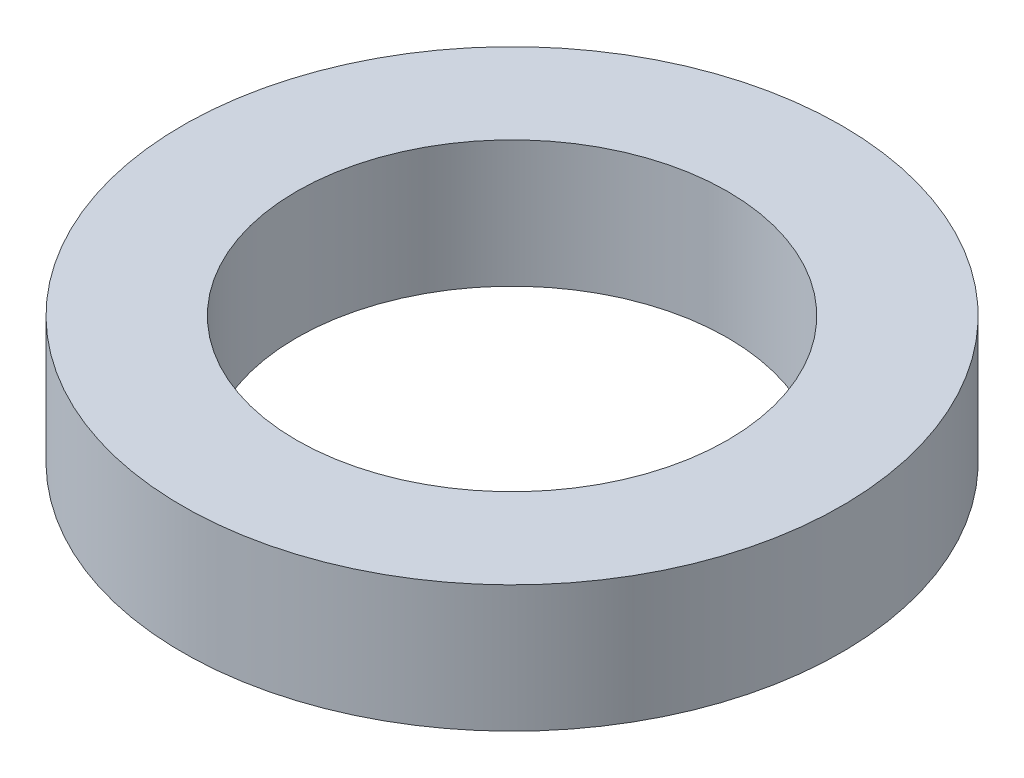
ISO-10303-21;
HEADER;
FILE_DESCRIPTION(('STEP AP214'),'2;1');
FILE_NAME('part.step','',(''),(''),'','','');
FILE_SCHEMA(('AUTOMOTIVE_DESIGN { 1 0 10303 214 1 1 1 1 }'));
ENDSEC;
DATA;
#1=APPLICATION_CONTEXT('core data for automotive mechanical design processes');
#2=APPLICATION_PROTOCOL_DEFINITION('international standard','automotive_design',2000,#1);
#3=PRODUCT_CONTEXT('',#1,'mechanical');
#4=PRODUCT('Part','Part','',(#3));
#5=PRODUCT_RELATED_PRODUCT_CATEGORY('part','',(#4));
#6=PRODUCT_DEFINITION_FORMATION('','',#4);
#7=PRODUCT_DEFINITION_CONTEXT('part definition',#1,'design');
#8=PRODUCT_DEFINITION('design','',#6,#7);
#9=PRODUCT_DEFINITION_SHAPE('','',#8);
#10=(LENGTH_UNIT() NAMED_UNIT(*) SI_UNIT(.MILLI.,.METRE.));
#11=(NAMED_UNIT(*) PLANE_ANGLE_UNIT() SI_UNIT($,.RADIAN.));
#12=(NAMED_UNIT(*) SI_UNIT($,.STERADIAN.) SOLID_ANGLE_UNIT());
#13=UNCERTAINTY_MEASURE_WITH_UNIT(LENGTH_MEASURE(1.E-05),#10,'distance_accuracy_value','');
#14=(GEOMETRIC_REPRESENTATION_CONTEXT(3) GLOBAL_UNCERTAINTY_ASSIGNED_CONTEXT((#13)) GLOBAL_UNIT_ASSIGNED_CONTEXT((#10,
#11,#12)) REPRESENTATION_CONTEXT('',''));
#15=CARTESIAN_POINT('',(0.,0.,0.));
#16=DIRECTION('',(0.,0.,1.));
#17=DIRECTION('',(1.,0.,0.));
#18=AXIS2_PLACEMENT_3D('',#15,#16,#17);
#19=CARTESIAN_POINT('',(0.,0.,0.));
#20=DIRECTION('',(0.,-1.,0.));
#21=DIRECTION('',(0.,0.,-1.));
#22=AXIS2_PLACEMENT_3D('',#19,#20,#21);
#23=CYLINDRICAL_SURFACE('',#22,8.50000000000038);
#24=CARTESIAN_POINT('',(0.,0.,0.));
#25=DIRECTION('',(0.,-1.,0.));
#26=DIRECTION('',(0.,0.,-1.));
#27=AXIS2_PLACEMENT_3D('',#24,#25,#26);
#28=CIRCLE('',#27,8.50000000000075);
#29=CARTESIAN_POINT('',(0.,0.,-8.50000000000075));
#30=VERTEX_POINT('',#29);
#31=EDGE_CURVE('E44',#30,#30,#28,.T.);
#32=ORIENTED_EDGE('',*,*,#31,.T.);
#33=EDGE_LOOP('',(#32));
#34=FACE_BOUND('',#33,.T.);
#35=CARTESIAN_POINT('',(0.,5.,0.));
#36=DIRECTION('',(0.,-1.,0.));
#37=DIRECTION('',(0.,0.,-1.));
#38=AXIS2_PLACEMENT_3D('',#35,#36,#37);
#39=CIRCLE('',#38,8.5);
#40=CARTESIAN_POINT('',(0.,5.,-8.5));
#41=VERTEX_POINT('',#40);
#42=EDGE_CURVE('E10',#41,#41,#39,.T.);
#43=ORIENTED_EDGE('',*,*,#42,.F.);
#44=EDGE_LOOP('',(#43));
#45=FACE_BOUND('',#44,.T.);
#46=ADVANCED_FACE('F30',(#34,#45),#23,.F.);
#47=CARTESIAN_POINT('',(8.5,5.,0.));
#48=DIRECTION('',(0.,1.,0.));
#49=DIRECTION('',(0.,0.,1.));
#50=AXIS2_PLACEMENT_3D('',#47,#48,#49);
#51=PLANE('',#50);
#52=ORIENTED_EDGE('',*,*,#42,.T.);
#53=EDGE_LOOP('',(#52));
#54=FACE_BOUND('',#53,.T.);
#55=CARTESIAN_POINT('',(0.,5.,0.));
#56=DIRECTION('',(0.,-1.,0.));
#57=DIRECTION('',(0.,0.,-1.));
#58=AXIS2_PLACEMENT_3D('',#55,#56,#57);
#59=CIRCLE('',#58,13.);
#60=CARTESIAN_POINT('',(0.,5.,-13.));
#61=VERTEX_POINT('',#60);
#62=EDGE_CURVE('E36',#61,#61,#59,.T.);
#63=ORIENTED_EDGE('',*,*,#62,.F.);
#64=EDGE_LOOP('',(#63));
#65=FACE_BOUND('',#64,.T.);
#66=ADVANCED_FACE('F60',(#54,#65),#51,.T.);
#67=CARTESIAN_POINT('',(0.,0.,0.));
#68=DIRECTION('',(0.,-1.,0.));
#69=DIRECTION('',(0.,0.,-1.));
#70=AXIS2_PLACEMENT_3D('',#67,#68,#69);
#71=CYLINDRICAL_SURFACE('',#70,13.);
#72=ORIENTED_EDGE('',*,*,#62,.T.);
#73=EDGE_LOOP('',(#72));
#74=FACE_BOUND('',#73,.T.);
#75=CARTESIAN_POINT('',(0.,0.,0.));
#76=DIRECTION('',(0.,-1.,0.));
#77=DIRECTION('',(0.,0.,-1.));
#78=AXIS2_PLACEMENT_3D('',#75,#76,#77);
#79=CIRCLE('',#78,13.);
#80=CARTESIAN_POINT('',(0.,0.,-13.));
#81=VERTEX_POINT('',#80);
#82=EDGE_CURVE('E40',#81,#81,#79,.T.);
#83=ORIENTED_EDGE('',*,*,#82,.F.);
#84=EDGE_LOOP('',(#83));
#85=FACE_BOUND('',#84,.T.);
#86=ADVANCED_FACE('F54',(#74,#85),#71,.T.);
#87=CARTESIAN_POINT('',(8.50000000000075,0.,0.));
#88=DIRECTION('',(0.,-1.,0.));
#89=DIRECTION('',(0.,0.,-1.));
#90=AXIS2_PLACEMENT_3D('',#87,#88,#89);
#91=PLANE('',#90);
#92=ORIENTED_EDGE('',*,*,#82,.T.);
#93=EDGE_LOOP('',(#92));
#94=FACE_BOUND('',#93,.T.);
#95=ORIENTED_EDGE('',*,*,#31,.F.);
#96=EDGE_LOOP('',(#95));
#97=FACE_BOUND('',#96,.T.);
#98=ADVANCED_FACE('F52',(#94,#97),#91,.T.);
#99=CLOSED_SHELL('',(#46,#66,#86,#98));
#100=MANIFOLD_SOLID_BREP('B2',#99);
#101=ADVANCED_BREP_SHAPE_REPRESENTATION('',(#18,#100),#14);
#102=SHAPE_DEFINITION_REPRESENTATION(#9,#101);
ENDSEC;
END-ISO-10303-21;
